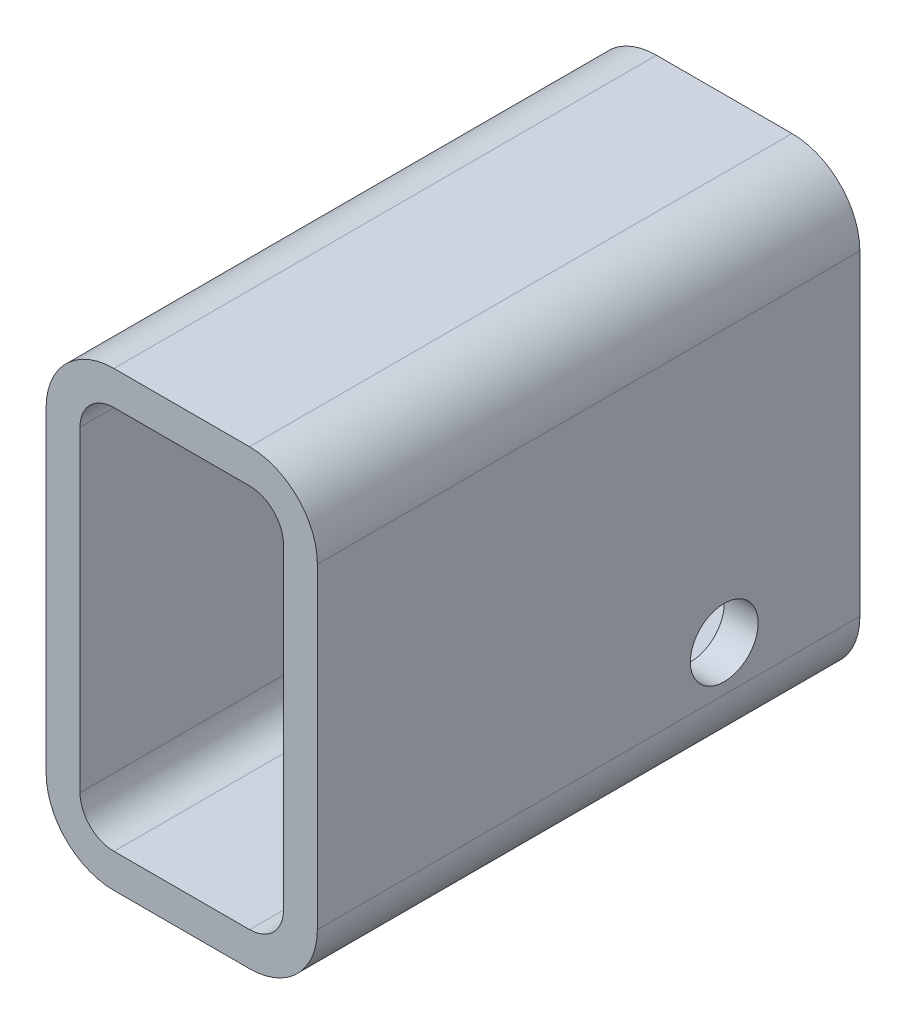
ISO-10303-21;
HEADER;
FILE_DESCRIPTION(('STEP AP214'),'2;1');
FILE_NAME('part.step','',(''),(''),'','','');
FILE_SCHEMA(('AUTOMOTIVE_DESIGN { 1 0 10303 214 1 1 1 1 }'));
ENDSEC;
DATA;
#1=APPLICATION_CONTEXT('core data for automotive mechanical design processes');
#2=APPLICATION_PROTOCOL_DEFINITION('international standard','automotive_design',2000,#1);
#3=PRODUCT_CONTEXT('',#1,'mechanical');
#4=PRODUCT('Part','Part','',(#3));
#5=PRODUCT_RELATED_PRODUCT_CATEGORY('part','',(#4));
#6=PRODUCT_DEFINITION_FORMATION('','',#4);
#7=PRODUCT_DEFINITION_CONTEXT('part definition',#1,'design');
#8=PRODUCT_DEFINITION('design','',#6,#7);
#9=PRODUCT_DEFINITION_SHAPE('','',#8);
#10=(LENGTH_UNIT() NAMED_UNIT(*) SI_UNIT(.MILLI.,.METRE.));
#11=(NAMED_UNIT(*) PLANE_ANGLE_UNIT() SI_UNIT($,.RADIAN.));
#12=(NAMED_UNIT(*) SI_UNIT($,.STERADIAN.) SOLID_ANGLE_UNIT());
#13=UNCERTAINTY_MEASURE_WITH_UNIT(LENGTH_MEASURE(1.E-05),#10,'distance_accuracy_value','');
#14=(GEOMETRIC_REPRESENTATION_CONTEXT(3) GLOBAL_UNCERTAINTY_ASSIGNED_CONTEXT((#13)) GLOBAL_UNIT_ASSIGNED_CONTEXT((#10,
#11,#12)) REPRESENTATION_CONTEXT('',''));
#15=CARTESIAN_POINT('',(0.,0.,0.));
#16=DIRECTION('',(0.,0.,1.));
#17=DIRECTION('',(1.,0.,0.));
#18=AXIS2_PLACEMENT_3D('',#15,#16,#17);
#19=CARTESIAN_POINT('',(57.15,107.95,76.2));
#20=DIRECTION('',(0.,0.,1.));
#21=DIRECTION('',(1.,0.,0.));
#22=AXIS2_PLACEMENT_3D('',#19,#20,#21);
#23=PLANE('',#22);
#24=CARTESIAN_POINT('',(57.15,107.95,76.2));
#25=DIRECTION('',(0.,0.,1.));
#26=DIRECTION('',(1.,0.,0.));
#27=AXIS2_PLACEMENT_3D('',#24,#25,#26);
#28=CIRCLE('',#27,19.05);
#29=CARTESIAN_POINT('',(76.2,107.95,76.2));
#30=VERTEX_POINT('',#29);
#31=CARTESIAN_POINT('',(57.15,127.,76.2));
#32=VERTEX_POINT('',#31);
#33=EDGE_CURVE('E215',#30,#32,#28,.T.);
#34=ORIENTED_EDGE('',*,*,#33,.T.);
#35=DIRECTION('',(-1.,0.,0.));
#36=VECTOR('',#35,1.);
#37=CARTESIAN_POINT('',(57.15,127.,76.2));
#38=LINE('',#37,#36);
#39=CARTESIAN_POINT('',(19.05,127.,76.2));
#40=VERTEX_POINT('',#39);
#41=EDGE_CURVE('E218',#32,#40,#38,.T.);
#42=ORIENTED_EDGE('',*,*,#41,.T.);
#43=CARTESIAN_POINT('',(19.05,107.95,76.2));
#44=DIRECTION('',(0.,0.,1.));
#45=DIRECTION('',(1.,0.,0.));
#46=AXIS2_PLACEMENT_3D('',#43,#44,#45);
#47=CIRCLE('',#46,19.05);
#48=CARTESIAN_POINT('',(0.,107.95,76.2));
#49=VERTEX_POINT('',#48);
#50=EDGE_CURVE('E221',#40,#49,#47,.T.);
#51=ORIENTED_EDGE('',*,*,#50,.T.);
#52=DIRECTION('',(0.,-1.,0.));
#53=VECTOR('',#52,1.);
#54=CARTESIAN_POINT('',(0.,19.05,76.2));
#55=LINE('',#54,#53);
#56=CARTESIAN_POINT('',(0.,19.05,76.2));
#57=VERTEX_POINT('',#56);
#58=EDGE_CURVE('E223',#49,#57,#55,.T.);
#59=ORIENTED_EDGE('',*,*,#58,.T.);
#60=CARTESIAN_POINT('',(19.05,19.05,76.2));
#61=DIRECTION('',(0.,0.,1.));
#62=DIRECTION('',(1.,0.,0.));
#63=AXIS2_PLACEMENT_3D('',#60,#61,#62);
#64=CIRCLE('',#63,19.05);
#65=CARTESIAN_POINT('',(19.05,0.,76.2));
#66=VERTEX_POINT('',#65);
#67=EDGE_CURVE('E225',#57,#66,#64,.T.);
#68=ORIENTED_EDGE('',*,*,#67,.T.);
#69=DIRECTION('',(1.,0.,0.));
#70=VECTOR('',#69,1.);
#71=CARTESIAN_POINT('',(19.05,0.,76.2));
#72=LINE('',#71,#70);
#73=CARTESIAN_POINT('',(57.15,0.,76.2));
#74=VERTEX_POINT('',#73);
#75=EDGE_CURVE('E227',#66,#74,#72,.T.);
#76=ORIENTED_EDGE('',*,*,#75,.T.);
#77=CARTESIAN_POINT('',(57.15,19.05,76.2));
#78=DIRECTION('',(0.,0.,1.));
#79=DIRECTION('',(1.,0.,0.));
#80=AXIS2_PLACEMENT_3D('',#77,#78,#79);
#81=CIRCLE('',#80,19.05);
#82=CARTESIAN_POINT('',(76.2,19.05,76.2));
#83=VERTEX_POINT('',#82);
#84=EDGE_CURVE('E229',#74,#83,#81,.T.);
#85=ORIENTED_EDGE('',*,*,#84,.T.);
#86=DIRECTION('',(0.,1.,0.));
#87=VECTOR('',#86,1.);
#88=CARTESIAN_POINT('',(76.2,107.95,76.2));
#89=LINE('',#88,#87);
#90=EDGE_CURVE('E231',#83,#30,#89,.T.);
#91=ORIENTED_EDGE('',*,*,#90,.T.);
#92=EDGE_LOOP('',(#34,#42,#51,#59,#68,#76,#85,#91));
#93=FACE_BOUND('',#92,.T.);
#94=DIRECTION('',(0.,-1.,0.));
#95=VECTOR('',#94,1.);
#96=CARTESIAN_POINT('',(9.525,19.05,76.2));
#97=LINE('',#96,#95);
#98=CARTESIAN_POINT('',(9.525,107.95,76.2));
#99=VERTEX_POINT('',#98);
#100=CARTESIAN_POINT('',(9.525,19.05,76.2));
#101=VERTEX_POINT('',#100);
#102=EDGE_CURVE('E156',#99,#101,#97,.T.);
#103=ORIENTED_EDGE('',*,*,#102,.F.);
#104=CARTESIAN_POINT('',(19.05,107.95,76.2));
#105=DIRECTION('',(0.,0.,1.));
#106=DIRECTION('',(1.,0.,0.));
#107=AXIS2_PLACEMENT_3D('',#104,#105,#106);
#108=CIRCLE('',#107,9.52499999999999);
#109=CARTESIAN_POINT('',(19.05,117.475,76.2));
#110=VERTEX_POINT('',#109);
#111=EDGE_CURVE('E148',#110,#99,#108,.T.);
#112=ORIENTED_EDGE('',*,*,#111,.F.);
#113=DIRECTION('',(-1.,0.,0.));
#114=VECTOR('',#113,1.);
#115=CARTESIAN_POINT('',(57.15,117.475,76.2));
#116=LINE('',#115,#114);
#117=CARTESIAN_POINT('',(57.15,117.475,76.2));
#118=VERTEX_POINT('',#117);
#119=EDGE_CURVE('E182',#118,#110,#116,.T.);
#120=ORIENTED_EDGE('',*,*,#119,.F.);
#121=CARTESIAN_POINT('',(57.15,107.95,76.2));
#122=DIRECTION('',(0.,0.,1.));
#123=DIRECTION('',(1.,0.,0.));
#124=AXIS2_PLACEMENT_3D('',#121,#122,#123);
#125=CIRCLE('',#124,9.52500000000001);
#126=CARTESIAN_POINT('',(66.675,107.95,76.2));
#127=VERTEX_POINT('',#126);
#128=EDGE_CURVE('E180',#127,#118,#125,.T.);
#129=ORIENTED_EDGE('',*,*,#128,.F.);
#130=DIRECTION('',(0.,1.,0.));
#131=VECTOR('',#130,1.);
#132=CARTESIAN_POINT('',(66.675,107.95,76.2));
#133=LINE('',#132,#131);
#134=CARTESIAN_POINT('',(66.675,19.05,76.2));
#135=VERTEX_POINT('',#134);
#136=EDGE_CURVE('E178',#135,#127,#133,.T.);
#137=ORIENTED_EDGE('',*,*,#136,.F.);
#138=CARTESIAN_POINT('',(57.15,19.05,76.2));
#139=DIRECTION('',(0.,0.,1.));
#140=DIRECTION('',(1.,0.,0.));
#141=AXIS2_PLACEMENT_3D('',#138,#139,#140);
#142=CIRCLE('',#141,9.52499999999999);
#143=CARTESIAN_POINT('',(57.15,9.52500000000001,76.2));
#144=VERTEX_POINT('',#143);
#145=EDGE_CURVE('E176',#144,#135,#142,.T.);
#146=ORIENTED_EDGE('',*,*,#145,.F.);
#147=DIRECTION('',(1.,0.,0.));
#148=VECTOR('',#147,1.);
#149=CARTESIAN_POINT('',(19.05,9.525,76.2));
#150=LINE('',#149,#148);
#151=CARTESIAN_POINT('',(19.05,9.525,76.2));
#152=VERTEX_POINT('',#151);
#153=EDGE_CURVE('E171',#152,#144,#150,.T.);
#154=ORIENTED_EDGE('',*,*,#153,.F.);
#155=CARTESIAN_POINT('',(19.05,19.05,76.2));
#156=DIRECTION('',(0.,0.,1.));
#157=DIRECTION('',(1.,0.,0.));
#158=AXIS2_PLACEMENT_3D('',#155,#156,#157);
#159=CIRCLE('',#158,9.525);
#160=EDGE_CURVE('E169',#101,#152,#159,.T.);
#161=ORIENTED_EDGE('',*,*,#160,.F.);
#162=EDGE_LOOP('',(#103,#112,#120,#129,#137,#146,#154,#161));
#163=FACE_BOUND('',#162,.T.);
#164=ADVANCED_FACE('F35',(#93,#163),#23,.T.);
#165=CARTESIAN_POINT('',(57.15,107.95,-76.2));
#166=DIRECTION('',(0.,0.,1.));
#167=DIRECTION('',(1.,0.,0.));
#168=AXIS2_PLACEMENT_3D('',#165,#166,#167);
#169=PLANE('',#168);
#170=CARTESIAN_POINT('',(57.15,107.95,-76.2));
#171=DIRECTION('',(0.,0.,1.));
#172=DIRECTION('',(1.,0.,0.));
#173=AXIS2_PLACEMENT_3D('',#170,#171,#172);
#174=CIRCLE('',#173,19.05);
#175=CARTESIAN_POINT('',(76.2,107.95,-76.2));
#176=VERTEX_POINT('',#175);
#177=CARTESIAN_POINT('',(57.15,127.,-76.2));
#178=VERTEX_POINT('',#177);
#179=EDGE_CURVE('E164',#176,#178,#174,.T.);
#180=ORIENTED_EDGE('',*,*,#179,.F.);
#181=DIRECTION('',(0.,1.,0.));
#182=VECTOR('',#181,1.);
#183=CARTESIAN_POINT('',(76.2,107.95,-76.2));
#184=LINE('',#183,#182);
#185=CARTESIAN_POINT('',(76.2,19.05,-76.2));
#186=VERTEX_POINT('',#185);
#187=EDGE_CURVE('E219',#186,#176,#184,.T.);
#188=ORIENTED_EDGE('',*,*,#187,.F.);
#189=CARTESIAN_POINT('',(57.15,19.05,-76.2));
#190=DIRECTION('',(0.,0.,1.));
#191=DIRECTION('',(1.,0.,0.));
#192=AXIS2_PLACEMENT_3D('',#189,#190,#191);
#193=CIRCLE('',#192,19.05);
#194=CARTESIAN_POINT('',(57.15,0.,-76.2));
#195=VERTEX_POINT('',#194);
#196=EDGE_CURVE('E246',#195,#186,#193,.T.);
#197=ORIENTED_EDGE('',*,*,#196,.F.);
#198=DIRECTION('',(1.,0.,0.));
#199=VECTOR('',#198,1.);
#200=CARTESIAN_POINT('',(19.05,0.,-76.2));
#201=LINE('',#200,#199);
#202=CARTESIAN_POINT('',(19.05,0.,-76.2));
#203=VERTEX_POINT('',#202);
#204=EDGE_CURVE('E244',#203,#195,#201,.T.);
#205=ORIENTED_EDGE('',*,*,#204,.F.);
#206=CARTESIAN_POINT('',(19.05,19.05,-76.2));
#207=DIRECTION('',(0.,0.,1.));
#208=DIRECTION('',(1.,0.,0.));
#209=AXIS2_PLACEMENT_3D('',#206,#207,#208);
#210=CIRCLE('',#209,19.05);
#211=CARTESIAN_POINT('',(0.,19.05,-76.2));
#212=VERTEX_POINT('',#211);
#213=EDGE_CURVE('E242',#212,#203,#210,.T.);
#214=ORIENTED_EDGE('',*,*,#213,.F.);
#215=DIRECTION('',(0.,-1.,0.));
#216=VECTOR('',#215,1.);
#217=CARTESIAN_POINT('',(0.,19.05,-76.2));
#218=LINE('',#217,#216);
#219=CARTESIAN_POINT('',(0.,107.95,-76.2));
#220=VERTEX_POINT('',#219);
#221=EDGE_CURVE('E240',#220,#212,#218,.T.);
#222=ORIENTED_EDGE('',*,*,#221,.F.);
#223=CARTESIAN_POINT('',(19.05,107.95,-76.2));
#224=DIRECTION('',(0.,0.,1.));
#225=DIRECTION('',(1.,0.,0.));
#226=AXIS2_PLACEMENT_3D('',#223,#224,#225);
#227=CIRCLE('',#226,19.05);
#228=CARTESIAN_POINT('',(19.05,127.,-76.2));
#229=VERTEX_POINT('',#228);
#230=EDGE_CURVE('E238',#229,#220,#227,.T.);
#231=ORIENTED_EDGE('',*,*,#230,.F.);
#232=DIRECTION('',(-1.,0.,0.));
#233=VECTOR('',#232,1.);
#234=CARTESIAN_POINT('',(57.15,127.,-76.2));
#235=LINE('',#234,#233);
#236=EDGE_CURVE('E236',#178,#229,#235,.T.);
#237=ORIENTED_EDGE('',*,*,#236,.F.);
#238=EDGE_LOOP('',(#180,#188,#197,#205,#214,#222,#231,#237));
#239=FACE_BOUND('',#238,.T.);
#240=CARTESIAN_POINT('',(19.05,107.95,-76.2));
#241=DIRECTION('',(0.,0.,1.));
#242=DIRECTION('',(1.,0.,0.));
#243=AXIS2_PLACEMENT_3D('',#240,#241,#242);
#244=CIRCLE('',#243,9.52499999999999);
#245=CARTESIAN_POINT('',(19.05,117.475,-76.2));
#246=VERTEX_POINT('',#245);
#247=CARTESIAN_POINT('',(9.525,107.95,-76.2));
#248=VERTEX_POINT('',#247);
#249=EDGE_CURVE('E58',#246,#248,#244,.T.);
#250=ORIENTED_EDGE('',*,*,#249,.T.);
#251=DIRECTION('',(0.,-1.,0.));
#252=VECTOR('',#251,1.);
#253=CARTESIAN_POINT('',(9.525,19.05,-76.2));
#254=LINE('',#253,#252);
#255=CARTESIAN_POINT('',(9.525,19.05,-76.2));
#256=VERTEX_POINT('',#255);
#257=EDGE_CURVE('E163',#248,#256,#254,.T.);
#258=ORIENTED_EDGE('',*,*,#257,.T.);
#259=CARTESIAN_POINT('',(19.05,19.05,-76.2));
#260=DIRECTION('',(0.,0.,1.));
#261=DIRECTION('',(1.,0.,0.));
#262=AXIS2_PLACEMENT_3D('',#259,#260,#261);
#263=CIRCLE('',#262,9.525);
#264=CARTESIAN_POINT('',(19.05,9.525,-76.2));
#265=VERTEX_POINT('',#264);
#266=EDGE_CURVE('E187',#256,#265,#263,.T.);
#267=ORIENTED_EDGE('',*,*,#266,.T.);
#268=DIRECTION('',(1.,0.,0.));
#269=VECTOR('',#268,1.);
#270=CARTESIAN_POINT('',(19.05,9.525,-76.2));
#271=LINE('',#270,#269);
#272=CARTESIAN_POINT('',(57.15,9.52500000000001,-76.2));
#273=VERTEX_POINT('',#272);
#274=EDGE_CURVE('E190',#265,#273,#271,.T.);
#275=ORIENTED_EDGE('',*,*,#274,.T.);
#276=CARTESIAN_POINT('',(57.15,19.05,-76.2));
#277=DIRECTION('',(0.,0.,1.));
#278=DIRECTION('',(1.,0.,0.));
#279=AXIS2_PLACEMENT_3D('',#276,#277,#278);
#280=CIRCLE('',#279,9.52499999999999);
#281=CARTESIAN_POINT('',(66.675,19.05,-76.2));
#282=VERTEX_POINT('',#281);
#283=EDGE_CURVE('E193',#273,#282,#280,.T.);
#284=ORIENTED_EDGE('',*,*,#283,.T.);
#285=DIRECTION('',(0.,1.,0.));
#286=VECTOR('',#285,1.);
#287=CARTESIAN_POINT('',(66.675,107.95,-76.2));
#288=LINE('',#287,#286);
#289=CARTESIAN_POINT('',(66.675,107.95,-76.2));
#290=VERTEX_POINT('',#289);
#291=EDGE_CURVE('E196',#282,#290,#288,.T.);
#292=ORIENTED_EDGE('',*,*,#291,.T.);
#293=CARTESIAN_POINT('',(57.15,107.95,-76.2));
#294=DIRECTION('',(0.,0.,1.));
#295=DIRECTION('',(1.,0.,0.));
#296=AXIS2_PLACEMENT_3D('',#293,#294,#295);
#297=CIRCLE('',#296,9.52500000000001);
#298=CARTESIAN_POINT('',(57.15,117.475,-76.2));
#299=VERTEX_POINT('',#298);
#300=EDGE_CURVE('E199',#290,#299,#297,.T.);
#301=ORIENTED_EDGE('',*,*,#300,.T.);
#302=DIRECTION('',(-1.,0.,0.));
#303=VECTOR('',#302,1.);
#304=CARTESIAN_POINT('',(57.15,117.475,-76.2));
#305=LINE('',#304,#303);
#306=EDGE_CURVE('E157',#299,#246,#305,.T.);
#307=ORIENTED_EDGE('',*,*,#306,.T.);
#308=EDGE_LOOP('',(#250,#258,#267,#275,#284,#292,#301,#307));
#309=FACE_BOUND('',#308,.T.);
#310=ADVANCED_FACE('F276',(#239,#309),#169,.F.);
#311=CARTESIAN_POINT('',(57.15,107.95,76.2));
#312=DIRECTION('',(0.,0.,-1.));
#313=DIRECTION('',(-1.,0.,0.));
#314=AXIS2_PLACEMENT_3D('',#311,#312,#313);
#315=CYLINDRICAL_SURFACE('',#314,19.05);
#316=ORIENTED_EDGE('',*,*,#179,.T.);
#317=DIRECTION('',(0.,0.,-1.));
#318=VECTOR('',#317,1.);
#319=CARTESIAN_POINT('',(57.15,127.,76.2));
#320=LINE('',#319,#318);
#321=EDGE_CURVE('E11',#32,#178,#320,.T.);
#322=ORIENTED_EDGE('',*,*,#321,.F.);
#323=ORIENTED_EDGE('',*,*,#33,.F.);
#324=DIRECTION('',(0.,0.,-1.));
#325=VECTOR('',#324,1.);
#326=CARTESIAN_POINT('',(76.2,107.95,76.2));
#327=LINE('',#326,#325);
#328=EDGE_CURVE('E233',#30,#176,#327,.T.);
#329=ORIENTED_EDGE('',*,*,#328,.T.);
#330=EDGE_LOOP('',(#316,#322,#323,#329));
#331=FACE_BOUND('',#330,.T.);
#332=ADVANCED_FACE('F37',(#331),#315,.T.);
#333=CARTESIAN_POINT('',(57.15,127.,76.2));
#334=DIRECTION('',(0.,-1.,0.));
#335=DIRECTION('',(0.,0.,-1.));
#336=AXIS2_PLACEMENT_3D('',#333,#334,#335);
#337=PLANE('',#336);
#338=ORIENTED_EDGE('',*,*,#236,.T.);
#339=DIRECTION('',(0.,0.,-1.));
#340=VECTOR('',#339,1.);
#341=CARTESIAN_POINT('',(19.05,127.,76.2));
#342=LINE('',#341,#340);
#343=EDGE_CURVE('E43',#40,#229,#342,.T.);
#344=ORIENTED_EDGE('',*,*,#343,.F.);
#345=ORIENTED_EDGE('',*,*,#41,.F.);
#346=ORIENTED_EDGE('',*,*,#321,.T.);
#347=EDGE_LOOP('',(#338,#344,#345,#346));
#348=FACE_BOUND('',#347,.T.);
#349=ADVANCED_FACE('F293',(#348),#337,.F.);
#350=CARTESIAN_POINT('',(19.05,107.95,76.2));
#351=DIRECTION('',(0.,0.,-1.));
#352=DIRECTION('',(-1.,0.,0.));
#353=AXIS2_PLACEMENT_3D('',#350,#351,#352);
#354=CYLINDRICAL_SURFACE('',#353,19.05);
#355=ORIENTED_EDGE('',*,*,#230,.T.);
#356=DIRECTION('',(0.,0.,-1.));
#357=VECTOR('',#356,1.);
#358=CARTESIAN_POINT('',(0.,107.95,76.2));
#359=LINE('',#358,#357);
#360=EDGE_CURVE('E263',#49,#220,#359,.T.);
#361=ORIENTED_EDGE('',*,*,#360,.F.);
#362=ORIENTED_EDGE('',*,*,#50,.F.);
#363=ORIENTED_EDGE('',*,*,#343,.T.);
#364=EDGE_LOOP('',(#355,#361,#362,#363));
#365=FACE_BOUND('',#364,.T.);
#366=ADVANCED_FACE('F270',(#365),#354,.T.);
#367=CARTESIAN_POINT('',(0.,19.05,76.2));
#368=DIRECTION('',(1.,0.,0.));
#369=DIRECTION('',(0.,0.,-1.));
#370=AXIS2_PLACEMENT_3D('',#367,#368,#369);
#371=PLANE('',#370);
#372=ORIENTED_EDGE('',*,*,#221,.T.);
#373=DIRECTION('',(0.,0.,-1.));
#374=VECTOR('',#373,1.);
#375=CARTESIAN_POINT('',(0.,19.05,76.2));
#376=LINE('',#375,#374);
#377=EDGE_CURVE('E260',#57,#212,#376,.T.);
#378=ORIENTED_EDGE('',*,*,#377,.F.);
#379=ORIENTED_EDGE('',*,*,#58,.F.);
#380=ORIENTED_EDGE('',*,*,#360,.T.);
#381=EDGE_LOOP('',(#372,#378,#379,#380));
#382=FACE_BOUND('',#381,.T.);
#383=ADVANCED_FACE('F282',(#382),#371,.F.);
#384=CARTESIAN_POINT('',(19.05,19.05,76.2));
#385=DIRECTION('',(0.,0.,-1.));
#386=DIRECTION('',(-1.,0.,0.));
#387=AXIS2_PLACEMENT_3D('',#384,#385,#386);
#388=CYLINDRICAL_SURFACE('',#387,19.05);
#389=ORIENTED_EDGE('',*,*,#213,.T.);
#390=DIRECTION('',(0.,0.,-1.));
#391=VECTOR('',#390,1.);
#392=CARTESIAN_POINT('',(19.05,0.,76.2));
#393=LINE('',#392,#391);
#394=EDGE_CURVE('E257',#66,#203,#393,.T.);
#395=ORIENTED_EDGE('',*,*,#394,.F.);
#396=ORIENTED_EDGE('',*,*,#67,.F.);
#397=ORIENTED_EDGE('',*,*,#377,.T.);
#398=EDGE_LOOP('',(#389,#395,#396,#397));
#399=FACE_BOUND('',#398,.T.);
#400=ADVANCED_FACE('F286',(#399),#388,.T.);
#401=CARTESIAN_POINT('',(19.05,0.,76.2));
#402=DIRECTION('',(0.,1.,0.));
#403=DIRECTION('',(-1.,0.,0.));
#404=AXIS2_PLACEMENT_3D('',#401,#402,#403);
#405=PLANE('',#404);
#406=ORIENTED_EDGE('',*,*,#204,.T.);
#407=DIRECTION('',(0.,0.,-1.));
#408=VECTOR('',#407,1.);
#409=CARTESIAN_POINT('',(57.15,0.,76.2));
#410=LINE('',#409,#408);
#411=EDGE_CURVE('E254',#74,#195,#410,.T.);
#412=ORIENTED_EDGE('',*,*,#411,.F.);
#413=ORIENTED_EDGE('',*,*,#75,.F.);
#414=ORIENTED_EDGE('',*,*,#394,.T.);
#415=EDGE_LOOP('',(#406,#412,#413,#414));
#416=FACE_BOUND('',#415,.T.);
#417=ADVANCED_FACE('F306',(#416),#405,.F.);
#418=CARTESIAN_POINT('',(57.15,19.05,76.2));
#419=DIRECTION('',(0.,0.,-1.));
#420=DIRECTION('',(-1.,0.,0.));
#421=AXIS2_PLACEMENT_3D('',#418,#419,#420);
#422=CYLINDRICAL_SURFACE('',#421,19.05);
#423=ORIENTED_EDGE('',*,*,#196,.T.);
#424=DIRECTION('',(0.,0.,-1.));
#425=VECTOR('',#424,1.);
#426=CARTESIAN_POINT('',(76.2,19.05,76.2));
#427=LINE('',#426,#425);
#428=EDGE_CURVE('E251',#83,#186,#427,.T.);
#429=ORIENTED_EDGE('',*,*,#428,.F.);
#430=ORIENTED_EDGE('',*,*,#84,.F.);
#431=ORIENTED_EDGE('',*,*,#411,.T.);
#432=EDGE_LOOP('',(#423,#429,#430,#431));
#433=FACE_BOUND('',#432,.T.);
#434=ADVANCED_FACE('F304',(#433),#422,.T.);
#435=CARTESIAN_POINT('',(76.2,107.95,76.2));
#436=DIRECTION('',(-1.,0.,0.));
#437=DIRECTION('',(0.,-1.,0.));
#438=AXIS2_PLACEMENT_3D('',#435,#436,#437);
#439=PLANE('',#438);
#440=CARTESIAN_POINT('',(76.2,31.75,-38.1));
#441=DIRECTION('',(1.,0.,0.));
#442=DIRECTION('',(0.,1.,0.));
#443=AXIS2_PLACEMENT_3D('',#440,#441,#442);
#444=CIRCLE('',#443,9.525);
#445=CARTESIAN_POINT('',(76.2,41.275,-38.1));
#446=VERTEX_POINT('',#445);
#447=EDGE_CURVE('E185',#446,#446,#444,.T.);
#448=ORIENTED_EDGE('',*,*,#447,.F.);
#449=EDGE_LOOP('',(#448));
#450=FACE_BOUND('',#449,.T.);
#451=ORIENTED_EDGE('',*,*,#187,.T.);
#452=ORIENTED_EDGE('',*,*,#328,.F.);
#453=ORIENTED_EDGE('',*,*,#90,.F.);
#454=ORIENTED_EDGE('',*,*,#428,.T.);
#455=EDGE_LOOP('',(#451,#452,#453,#454));
#456=FACE_BOUND('',#455,.T.);
#457=ADVANCED_FACE('F299',(#450,#456),#439,.F.);
#458=CARTESIAN_POINT('',(19.05,107.95,76.2));
#459=DIRECTION('',(0.,0.,-1.));
#460=DIRECTION('',(-1.,0.,0.));
#461=AXIS2_PLACEMENT_3D('',#458,#459,#460);
#462=CYLINDRICAL_SURFACE('',#461,9.52499999999999);
#463=ORIENTED_EDGE('',*,*,#249,.F.);
#464=DIRECTION('',(0.,0.,-1.));
#465=VECTOR('',#464,1.);
#466=CARTESIAN_POINT('',(19.05,117.475,76.2));
#467=LINE('',#466,#465);
#468=EDGE_CURVE('E152',#110,#246,#467,.T.);
#469=ORIENTED_EDGE('',*,*,#468,.F.);
#470=ORIENTED_EDGE('',*,*,#111,.T.);
#471=DIRECTION('',(0.,0.,-1.));
#472=VECTOR('',#471,1.);
#473=CARTESIAN_POINT('',(9.525,107.95,76.2));
#474=LINE('',#473,#472);
#475=EDGE_CURVE('E151',#99,#248,#474,.T.);
#476=ORIENTED_EDGE('',*,*,#475,.T.);
#477=EDGE_LOOP('',(#463,#469,#470,#476));
#478=FACE_BOUND('',#477,.T.);
#479=ADVANCED_FACE('F150',(#478),#462,.F.);
#480=CARTESIAN_POINT('',(9.525,19.05,76.2));
#481=DIRECTION('',(1.,0.,0.));
#482=DIRECTION('',(0.,1.,0.));
#483=AXIS2_PLACEMENT_3D('',#480,#481,#482);
#484=PLANE('',#483);
#485=ORIENTED_EDGE('',*,*,#257,.F.);
#486=ORIENTED_EDGE('',*,*,#475,.F.);
#487=ORIENTED_EDGE('',*,*,#102,.T.);
#488=DIRECTION('',(0.,0.,-1.));
#489=VECTOR('',#488,1.);
#490=CARTESIAN_POINT('',(9.525,19.05,76.2));
#491=LINE('',#490,#489);
#492=EDGE_CURVE('E165',#101,#256,#491,.T.);
#493=ORIENTED_EDGE('',*,*,#492,.T.);
#494=EDGE_LOOP('',(#485,#486,#487,#493));
#495=FACE_BOUND('',#494,.T.);
#496=ADVANCED_FACE('F160',(#495),#484,.T.);
#497=CARTESIAN_POINT('',(19.05,19.05,76.2));
#498=DIRECTION('',(0.,0.,-1.));
#499=DIRECTION('',(-1.,0.,0.));
#500=AXIS2_PLACEMENT_3D('',#497,#498,#499);
#501=CYLINDRICAL_SURFACE('',#500,9.525);
#502=ORIENTED_EDGE('',*,*,#266,.F.);
#503=ORIENTED_EDGE('',*,*,#492,.F.);
#504=ORIENTED_EDGE('',*,*,#160,.T.);
#505=DIRECTION('',(0.,0.,-1.));
#506=VECTOR('',#505,1.);
#507=CARTESIAN_POINT('',(19.05,9.525,76.2));
#508=LINE('',#507,#506);
#509=EDGE_CURVE('E212',#152,#265,#508,.T.);
#510=ORIENTED_EDGE('',*,*,#509,.T.);
#511=EDGE_LOOP('',(#502,#503,#504,#510));
#512=FACE_BOUND('',#511,.T.);
#513=ADVANCED_FACE('F362',(#512),#501,.F.);
#514=CARTESIAN_POINT('',(19.05,9.525,76.2));
#515=DIRECTION('',(0.,1.,0.));
#516=DIRECTION('',(0.,0.,1.));
#517=AXIS2_PLACEMENT_3D('',#514,#515,#516);
#518=PLANE('',#517);
#519=ORIENTED_EDGE('',*,*,#274,.F.);
#520=ORIENTED_EDGE('',*,*,#509,.F.);
#521=ORIENTED_EDGE('',*,*,#153,.T.);
#522=DIRECTION('',(0.,0.,-1.));
#523=VECTOR('',#522,1.);
#524=CARTESIAN_POINT('',(57.15,9.52500000000001,76.2));
#525=LINE('',#524,#523);
#526=EDGE_CURVE('E210',#144,#273,#525,.T.);
#527=ORIENTED_EDGE('',*,*,#526,.T.);
#528=EDGE_LOOP('',(#519,#520,#521,#527));
#529=FACE_BOUND('',#528,.T.);
#530=ADVANCED_FACE('F358',(#529),#518,.T.);
#531=CARTESIAN_POINT('',(57.15,19.05,76.2));
#532=DIRECTION('',(0.,0.,-1.));
#533=DIRECTION('',(-1.,0.,0.));
#534=AXIS2_PLACEMENT_3D('',#531,#532,#533);
#535=CYLINDRICAL_SURFACE('',#534,9.52499999999999);
#536=ORIENTED_EDGE('',*,*,#283,.F.);
#537=ORIENTED_EDGE('',*,*,#526,.F.);
#538=ORIENTED_EDGE('',*,*,#145,.T.);
#539=DIRECTION('',(0.,0.,-1.));
#540=VECTOR('',#539,1.);
#541=CARTESIAN_POINT('',(66.675,19.05,76.2));
#542=LINE('',#541,#540);
#543=EDGE_CURVE('E208',#135,#282,#542,.T.);
#544=ORIENTED_EDGE('',*,*,#543,.T.);
#545=EDGE_LOOP('',(#536,#537,#538,#544));
#546=FACE_BOUND('',#545,.T.);
#547=ADVANCED_FACE('F355',(#546),#535,.F.);
#548=CARTESIAN_POINT('',(66.675,107.95,76.2));
#549=DIRECTION('',(-1.,0.,0.));
#550=DIRECTION('',(0.,-1.,0.));
#551=AXIS2_PLACEMENT_3D('',#548,#549,#550);
#552=PLANE('',#551);
#553=CARTESIAN_POINT('',(66.675,31.75,-38.1));
#554=DIRECTION('',(-1.,0.,0.));
#555=DIRECTION('',(0.,-1.,0.));
#556=AXIS2_PLACEMENT_3D('',#553,#554,#555);
#557=CIRCLE('',#556,9.525);
#558=CARTESIAN_POINT('',(66.675,22.225,-38.1));
#559=VERTEX_POINT('',#558);
#560=EDGE_CURVE('E332',#559,#559,#557,.F.);
#561=ORIENTED_EDGE('',*,*,#560,.T.);
#562=EDGE_LOOP('',(#561));
#563=FACE_BOUND('',#562,.T.);
#564=ORIENTED_EDGE('',*,*,#291,.F.);
#565=ORIENTED_EDGE('',*,*,#543,.F.);
#566=ORIENTED_EDGE('',*,*,#136,.T.);
#567=DIRECTION('',(0.,0.,-1.));
#568=VECTOR('',#567,1.);
#569=CARTESIAN_POINT('',(66.675,107.95,76.2));
#570=LINE('',#569,#568);
#571=EDGE_CURVE('E206',#127,#290,#570,.T.);
#572=ORIENTED_EDGE('',*,*,#571,.T.);
#573=EDGE_LOOP('',(#564,#565,#566,#572));
#574=FACE_BOUND('',#573,.T.);
#575=ADVANCED_FACE('F337',(#563,#574),#552,.T.);
#576=CARTESIAN_POINT('',(57.15,107.95,76.2));
#577=DIRECTION('',(0.,0.,-1.));
#578=DIRECTION('',(-1.,0.,0.));
#579=AXIS2_PLACEMENT_3D('',#576,#577,#578);
#580=CYLINDRICAL_SURFACE('',#579,9.52500000000001);
#581=ORIENTED_EDGE('',*,*,#300,.F.);
#582=ORIENTED_EDGE('',*,*,#571,.F.);
#583=ORIENTED_EDGE('',*,*,#128,.T.);
#584=DIRECTION('',(0.,0.,-1.));
#585=VECTOR('',#584,1.);
#586=CARTESIAN_POINT('',(57.15,117.475,76.2));
#587=LINE('',#586,#585);
#588=EDGE_CURVE('E50',#118,#299,#587,.T.);
#589=ORIENTED_EDGE('',*,*,#588,.T.);
#590=EDGE_LOOP('',(#581,#582,#583,#589));
#591=FACE_BOUND('',#590,.T.);
#592=ADVANCED_FACE('F347',(#591),#580,.F.);
#593=CARTESIAN_POINT('',(57.15,117.475,76.2));
#594=DIRECTION('',(0.,-1.,0.));
#595=DIRECTION('',(1.,0.,0.));
#596=AXIS2_PLACEMENT_3D('',#593,#594,#595);
#597=PLANE('',#596);
#598=ORIENTED_EDGE('',*,*,#306,.F.);
#599=ORIENTED_EDGE('',*,*,#588,.F.);
#600=ORIENTED_EDGE('',*,*,#119,.T.);
#601=ORIENTED_EDGE('',*,*,#468,.T.);
#602=EDGE_LOOP('',(#598,#599,#600,#601));
#603=FACE_BOUND('',#602,.T.);
#604=ADVANCED_FACE('F342',(#603),#597,.T.);
#605=CARTESIAN_POINT('',(-0.00100000000001488,31.75,-38.1));
#606=DIRECTION('',(1.,0.,0.));
#607=DIRECTION('',(0.,1.,0.));
#608=AXIS2_PLACEMENT_3D('',#605,#606,#607);
#609=CYLINDRICAL_SURFACE('',#608,9.525);
#610=ORIENTED_EDGE('',*,*,#560,.F.);
#611=EDGE_LOOP('',(#610));
#612=FACE_BOUND('',#611,.T.);
#613=ORIENTED_EDGE('',*,*,#447,.T.);
#614=EDGE_LOOP('',(#613));
#615=FACE_BOUND('',#614,.T.);
#616=ADVANCED_FACE('F340',(#612,#615),#609,.F.);
#617=CLOSED_SHELL('',(#164,#310,#332,#349,#366,#383,#400,#417,#434,#457,#479,#496,#513,#530,
#547,#575,#592,#604,#616));
#618=MANIFOLD_SOLID_BREP('B2',#617);
#619=ADVANCED_BREP_SHAPE_REPRESENTATION('',(#18,#618),#14);
#620=SHAPE_DEFINITION_REPRESENTATION(#9,#619);
ENDSEC;
END-ISO-10303-21;
